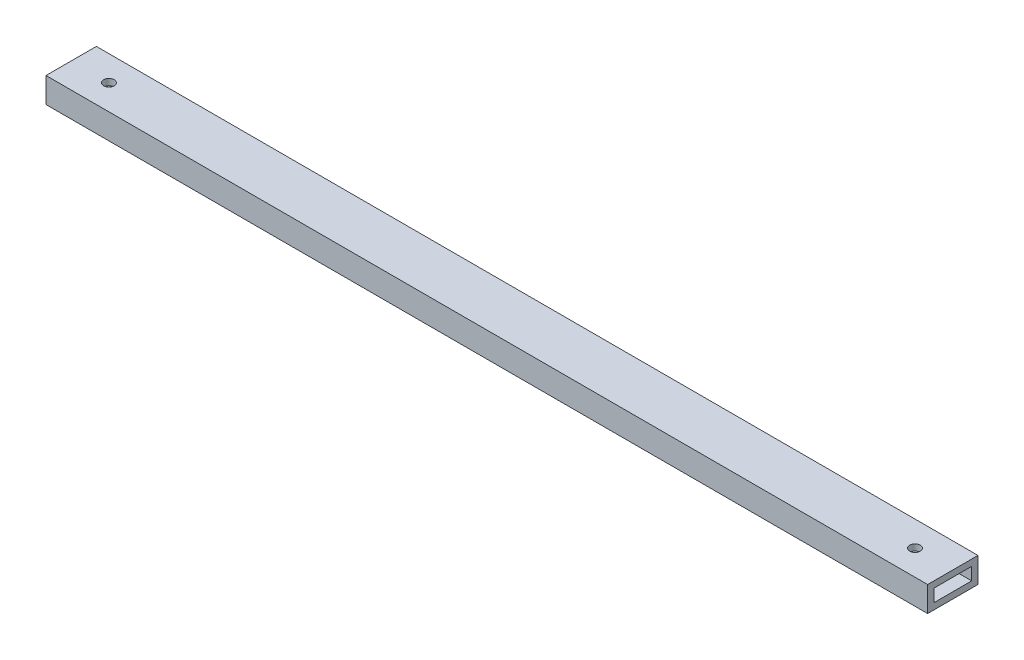
ISO-10303-21;
HEADER;
FILE_DESCRIPTION(('STEP AP214'),'2;1');
FILE_NAME('part.step','',(''),(''),'','','');
FILE_SCHEMA(('AUTOMOTIVE_DESIGN { 1 0 10303 214 1 1 1 1 }'));
ENDSEC;
DATA;
#1=APPLICATION_CONTEXT('core data for automotive mechanical design processes');
#2=APPLICATION_PROTOCOL_DEFINITION('international standard','automotive_design',2000,#1);
#3=PRODUCT_CONTEXT('',#1,'mechanical');
#4=PRODUCT('Part','Part','',(#3));
#5=PRODUCT_RELATED_PRODUCT_CATEGORY('part','',(#4));
#6=PRODUCT_DEFINITION_FORMATION('','',#4);
#7=PRODUCT_DEFINITION_CONTEXT('part definition',#1,'design');
#8=PRODUCT_DEFINITION('design','',#6,#7);
#9=PRODUCT_DEFINITION_SHAPE('','',#8);
#10=(LENGTH_UNIT() NAMED_UNIT(*) SI_UNIT(.MILLI.,.METRE.));
#11=(NAMED_UNIT(*) PLANE_ANGLE_UNIT() SI_UNIT($,.RADIAN.));
#12=(NAMED_UNIT(*) SI_UNIT($,.STERADIAN.) SOLID_ANGLE_UNIT());
#13=UNCERTAINTY_MEASURE_WITH_UNIT(LENGTH_MEASURE(1.E-05),#10,'distance_accuracy_value','');
#14=(GEOMETRIC_REPRESENTATION_CONTEXT(3) GLOBAL_UNCERTAINTY_ASSIGNED_CONTEXT((#13)) GLOBAL_UNIT_ASSIGNED_CONTEXT((#10,
#11,#12)) REPRESENTATION_CONTEXT('',''));
#15=CARTESIAN_POINT('',(0.,0.,0.));
#16=DIRECTION('',(0.,0.,1.));
#17=DIRECTION('',(1.,0.,0.));
#18=AXIS2_PLACEMENT_3D('',#15,#16,#17);
#19=CARTESIAN_POINT('',(444.5,0.,0.));
#20=DIRECTION('',(-1.,0.,0.));
#21=DIRECTION('',(0.,0.,1.));
#22=AXIS2_PLACEMENT_3D('',#19,#20,#21);
#23=PLANE('',#22);
#24=DIRECTION('',(0.,-1.,0.));
#25=VECTOR('',#24,1.);
#26=CARTESIAN_POINT('',(444.5,0.,0.));
#27=LINE('',#26,#25);
#28=CARTESIAN_POINT('',(444.5,12.7,0.));
#29=VERTEX_POINT('',#28);
#30=CARTESIAN_POINT('',(444.5,0.,0.));
#31=VERTEX_POINT('',#30);
#32=EDGE_CURVE('E162',#29,#31,#27,.T.);
#33=ORIENTED_EDGE('',*,*,#32,.T.);
#34=DIRECTION('',(0.,0.,-1.));
#35=VECTOR('',#34,1.);
#36=CARTESIAN_POINT('',(444.5,0.,0.));
#37=LINE('',#36,#35);
#38=CARTESIAN_POINT('',(444.5,0.,-25.4));
#39=VERTEX_POINT('',#38);
#40=EDGE_CURVE('E166',#31,#39,#37,.T.);
#41=ORIENTED_EDGE('',*,*,#40,.T.);
#42=DIRECTION('',(0.,1.,0.));
#43=VECTOR('',#42,1.);
#44=CARTESIAN_POINT('',(444.5,0.,-25.4));
#45=LINE('',#44,#43);
#46=CARTESIAN_POINT('',(444.5,12.7,-25.4));
#47=VERTEX_POINT('',#46);
#48=EDGE_CURVE('E170',#39,#47,#45,.T.);
#49=ORIENTED_EDGE('',*,*,#48,.T.);
#50=DIRECTION('',(0.,0.,1.));
#51=VECTOR('',#50,1.);
#52=CARTESIAN_POINT('',(444.5,12.7,0.));
#53=LINE('',#52,#51);
#54=EDGE_CURVE('E173',#47,#29,#53,.T.);
#55=ORIENTED_EDGE('',*,*,#54,.T.);
#56=EDGE_LOOP('',(#33,#41,#49,#55));
#57=FACE_BOUND('',#56,.T.);
#58=DIRECTION('',(0.,-1.,0.));
#59=VECTOR('',#58,1.);
#60=CARTESIAN_POINT('',(444.5,3.175,-3.175));
#61=LINE('',#60,#59);
#62=CARTESIAN_POINT('',(444.5,9.525,-3.175));
#63=VERTEX_POINT('',#62);
#64=CARTESIAN_POINT('',(444.5,3.175,-3.175));
#65=VERTEX_POINT('',#64);
#66=EDGE_CURVE('E115',#63,#65,#61,.T.);
#67=ORIENTED_EDGE('',*,*,#66,.F.);
#68=DIRECTION('',(0.,0.,1.));
#69=VECTOR('',#68,1.);
#70=CARTESIAN_POINT('',(444.5,9.525,-3.175));
#71=LINE('',#70,#69);
#72=CARTESIAN_POINT('',(444.5,9.525,-22.225));
#73=VERTEX_POINT('',#72);
#74=EDGE_CURVE('E143',#73,#63,#71,.T.);
#75=ORIENTED_EDGE('',*,*,#74,.F.);
#76=DIRECTION('',(0.,1.,0.));
#77=VECTOR('',#76,1.);
#78=CARTESIAN_POINT('',(444.5,3.175,-22.225));
#79=LINE('',#78,#77);
#80=CARTESIAN_POINT('',(444.5,3.175,-22.225));
#81=VERTEX_POINT('',#80);
#82=EDGE_CURVE('E137',#81,#73,#79,.T.);
#83=ORIENTED_EDGE('',*,*,#82,.F.);
#84=DIRECTION('',(0.,0.,-1.));
#85=VECTOR('',#84,1.);
#86=CARTESIAN_POINT('',(444.5,3.175,-3.175));
#87=LINE('',#86,#85);
#88=EDGE_CURVE('E124',#65,#81,#87,.T.);
#89=ORIENTED_EDGE('',*,*,#88,.F.);
#90=EDGE_LOOP('',(#67,#75,#83,#89));
#91=FACE_BOUND('',#90,.T.);
#92=ADVANCED_FACE('F38',(#57,#91),#23,.F.);
#93=CARTESIAN_POINT('',(0.,0.,0.));
#94=DIRECTION('',(-1.,0.,0.));
#95=DIRECTION('',(0.,0.,1.));
#96=AXIS2_PLACEMENT_3D('',#93,#94,#95);
#97=PLANE('',#96);
#98=DIRECTION('',(0.,-1.,0.));
#99=VECTOR('',#98,1.);
#100=CARTESIAN_POINT('',(0.,0.,0.));
#101=LINE('',#100,#99);
#102=CARTESIAN_POINT('',(0.,12.7,0.));
#103=VERTEX_POINT('',#102);
#104=CARTESIAN_POINT('',(0.,0.,0.));
#105=VERTEX_POINT('',#104);
#106=EDGE_CURVE('E133',#103,#105,#101,.T.);
#107=ORIENTED_EDGE('',*,*,#106,.F.);
#108=DIRECTION('',(0.,0.,1.));
#109=VECTOR('',#108,1.);
#110=CARTESIAN_POINT('',(0.,12.7,0.));
#111=LINE('',#110,#109);
#112=CARTESIAN_POINT('',(0.,12.7,-25.4));
#113=VERTEX_POINT('',#112);
#114=EDGE_CURVE('E167',#113,#103,#111,.T.);
#115=ORIENTED_EDGE('',*,*,#114,.F.);
#116=DIRECTION('',(0.,1.,0.));
#117=VECTOR('',#116,1.);
#118=CARTESIAN_POINT('',(0.,0.,-25.4));
#119=LINE('',#118,#117);
#120=CARTESIAN_POINT('',(0.,0.,-25.4));
#121=VERTEX_POINT('',#120);
#122=EDGE_CURVE('E183',#121,#113,#119,.T.);
#123=ORIENTED_EDGE('',*,*,#122,.F.);
#124=DIRECTION('',(0.,0.,-1.));
#125=VECTOR('',#124,1.);
#126=CARTESIAN_POINT('',(0.,0.,0.));
#127=LINE('',#126,#125);
#128=EDGE_CURVE('E180',#105,#121,#127,.T.);
#129=ORIENTED_EDGE('',*,*,#128,.F.);
#130=EDGE_LOOP('',(#107,#115,#123,#129));
#131=FACE_BOUND('',#130,.T.);
#132=DIRECTION('',(0.,0.,1.));
#133=VECTOR('',#132,1.);
#134=CARTESIAN_POINT('',(0.,9.525,-3.175));
#135=LINE('',#134,#133);
#136=CARTESIAN_POINT('',(0.,9.525,-22.225));
#137=VERTEX_POINT('',#136);
#138=CARTESIAN_POINT('',(0.,9.525,-3.175));
#139=VERTEX_POINT('',#138);
#140=EDGE_CURVE('E125',#137,#139,#135,.T.);
#141=ORIENTED_EDGE('',*,*,#140,.T.);
#142=DIRECTION('',(0.,-1.,0.));
#143=VECTOR('',#142,1.);
#144=CARTESIAN_POINT('',(0.,3.175,-3.175));
#145=LINE('',#144,#143);
#146=CARTESIAN_POINT('',(0.,3.175,-3.175));
#147=VERTEX_POINT('',#146);
#148=EDGE_CURVE('E67',#139,#147,#145,.T.);
#149=ORIENTED_EDGE('',*,*,#148,.T.);
#150=DIRECTION('',(0.,0.,-1.));
#151=VECTOR('',#150,1.);
#152=CARTESIAN_POINT('',(0.,3.175,-3.175));
#153=LINE('',#152,#151);
#154=CARTESIAN_POINT('',(0.,3.175,-22.225));
#155=VERTEX_POINT('',#154);
#156=EDGE_CURVE('E131',#147,#155,#153,.T.);
#157=ORIENTED_EDGE('',*,*,#156,.T.);
#158=DIRECTION('',(0.,1.,0.));
#159=VECTOR('',#158,1.);
#160=CARTESIAN_POINT('',(0.,3.175,-22.225));
#161=LINE('',#160,#159);
#162=EDGE_CURVE('E151',#155,#137,#161,.T.);
#163=ORIENTED_EDGE('',*,*,#162,.T.);
#164=EDGE_LOOP('',(#141,#149,#157,#163));
#165=FACE_BOUND('',#164,.T.);
#166=ADVANCED_FACE('F236',(#131,#165),#97,.T.);
#167=CARTESIAN_POINT('',(444.5,0.,0.));
#168=DIRECTION('',(0.,0.,-1.));
#169=DIRECTION('',(-1.,0.,0.));
#170=AXIS2_PLACEMENT_3D('',#167,#168,#169);
#171=PLANE('',#170);
#172=ORIENTED_EDGE('',*,*,#106,.T.);
#173=DIRECTION('',(-1.,0.,0.));
#174=VECTOR('',#173,1.);
#175=CARTESIAN_POINT('',(444.5,0.,0.));
#176=LINE('',#175,#174);
#177=EDGE_CURVE('E11',#31,#105,#176,.T.);
#178=ORIENTED_EDGE('',*,*,#177,.F.);
#179=ORIENTED_EDGE('',*,*,#32,.F.);
#180=DIRECTION('',(-1.,0.,0.));
#181=VECTOR('',#180,1.);
#182=CARTESIAN_POINT('',(444.5,12.7,0.));
#183=LINE('',#182,#181);
#184=EDGE_CURVE('E176',#29,#103,#183,.T.);
#185=ORIENTED_EDGE('',*,*,#184,.T.);
#186=EDGE_LOOP('',(#172,#178,#179,#185));
#187=FACE_BOUND('',#186,.T.);
#188=ADVANCED_FACE('F40',(#187),#171,.F.);
#189=CARTESIAN_POINT('',(444.5,0.,0.));
#190=DIRECTION('',(0.,1.,0.));
#191=DIRECTION('',(0.,0.,1.));
#192=AXIS2_PLACEMENT_3D('',#189,#190,#191);
#193=PLANE('',#192);
#194=CARTESIAN_POINT('',(19.05,0.,-12.7));
#195=DIRECTION('',(0.,1.,0.));
#196=DIRECTION('',(0.,0.,1.));
#197=AXIS2_PLACEMENT_3D('',#194,#195,#196);
#198=CIRCLE('',#197,2.667);
#199=CARTESIAN_POINT('',(19.05,0.,-10.033));
#200=VERTEX_POINT('',#199);
#201=EDGE_CURVE('E199',#200,#200,#198,.T.);
#202=ORIENTED_EDGE('',*,*,#201,.T.);
#203=EDGE_LOOP('',(#202));
#204=FACE_BOUND('',#203,.T.);
#205=CARTESIAN_POINT('',(425.45,0.,-12.7));
#206=DIRECTION('',(0.,1.,0.));
#207=DIRECTION('',(0.,0.,-1.));
#208=AXIS2_PLACEMENT_3D('',#205,#206,#207);
#209=CIRCLE('',#208,2.66700000000002);
#210=CARTESIAN_POINT('',(425.45,0.,-15.367));
#211=VERTEX_POINT('',#210);
#212=EDGE_CURVE('E212',#211,#211,#209,.T.);
#213=ORIENTED_EDGE('',*,*,#212,.T.);
#214=EDGE_LOOP('',(#213));
#215=FACE_BOUND('',#214,.T.);
#216=ORIENTED_EDGE('',*,*,#128,.T.);
#217=DIRECTION('',(-1.,0.,0.));
#218=VECTOR('',#217,1.);
#219=CARTESIAN_POINT('',(444.5,0.,-25.4));
#220=LINE('',#219,#218);
#221=EDGE_CURVE('E48',#39,#121,#220,.T.);
#222=ORIENTED_EDGE('',*,*,#221,.F.);
#223=ORIENTED_EDGE('',*,*,#40,.F.);
#224=ORIENTED_EDGE('',*,*,#177,.T.);
#225=EDGE_LOOP('',(#216,#222,#223,#224));
#226=FACE_BOUND('',#225,.T.);
#227=ADVANCED_FACE('F261',(#204,#215,#226),#193,.F.);
#228=CARTESIAN_POINT('',(444.5,0.,-25.4));
#229=DIRECTION('',(0.,0.,1.));
#230=DIRECTION('',(1.,0.,0.));
#231=AXIS2_PLACEMENT_3D('',#228,#229,#230);
#232=PLANE('',#231);
#233=ORIENTED_EDGE('',*,*,#122,.T.);
#234=DIRECTION('',(-1.,0.,0.));
#235=VECTOR('',#234,1.);
#236=CARTESIAN_POINT('',(444.5,12.7,-25.4));
#237=LINE('',#236,#235);
#238=EDGE_CURVE('E189',#47,#113,#237,.T.);
#239=ORIENTED_EDGE('',*,*,#238,.F.);
#240=ORIENTED_EDGE('',*,*,#48,.F.);
#241=ORIENTED_EDGE('',*,*,#221,.T.);
#242=EDGE_LOOP('',(#233,#239,#240,#241));
#243=FACE_BOUND('',#242,.T.);
#244=ADVANCED_FACE('F258',(#243),#232,.F.);
#245=CARTESIAN_POINT('',(444.5,12.7,0.));
#246=DIRECTION('',(0.,-1.,0.));
#247=DIRECTION('',(0.,0.,-1.));
#248=AXIS2_PLACEMENT_3D('',#245,#246,#247);
#249=PLANE('',#248);
#250=CARTESIAN_POINT('',(19.05,12.7,-12.7));
#251=DIRECTION('',(0.,1.,0.));
#252=DIRECTION('',(0.,0.,1.));
#253=AXIS2_PLACEMENT_3D('',#250,#251,#252);
#254=CIRCLE('',#253,2.667);
#255=CARTESIAN_POINT('',(19.05,12.7,-10.033));
#256=VERTEX_POINT('',#255);
#257=EDGE_CURVE('E207',#256,#256,#254,.T.);
#258=ORIENTED_EDGE('',*,*,#257,.F.);
#259=EDGE_LOOP('',(#258));
#260=FACE_BOUND('',#259,.T.);
#261=CARTESIAN_POINT('',(425.45,12.7,-12.7));
#262=DIRECTION('',(0.,1.,0.));
#263=DIRECTION('',(0.,0.,-1.));
#264=AXIS2_PLACEMENT_3D('',#261,#262,#263);
#265=CIRCLE('',#264,2.66700000000002);
#266=CARTESIAN_POINT('',(425.45,12.7,-15.367));
#267=VERTEX_POINT('',#266);
#268=EDGE_CURVE('E217',#267,#267,#265,.T.);
#269=ORIENTED_EDGE('',*,*,#268,.F.);
#270=EDGE_LOOP('',(#269));
#271=FACE_BOUND('',#270,.T.);
#272=ORIENTED_EDGE('',*,*,#114,.T.);
#273=ORIENTED_EDGE('',*,*,#184,.F.);
#274=ORIENTED_EDGE('',*,*,#54,.F.);
#275=ORIENTED_EDGE('',*,*,#238,.T.);
#276=EDGE_LOOP('',(#272,#273,#274,#275));
#277=FACE_BOUND('',#276,.T.);
#278=ADVANCED_FACE('F255',(#260,#271,#277),#249,.F.);
#279=CARTESIAN_POINT('',(444.5,3.175,-3.175));
#280=DIRECTION('',(0.,0.,-1.));
#281=DIRECTION('',(-1.,0.,0.));
#282=AXIS2_PLACEMENT_3D('',#279,#280,#281);
#283=PLANE('',#282);
#284=ORIENTED_EDGE('',*,*,#148,.F.);
#285=DIRECTION('',(-1.,0.,0.));
#286=VECTOR('',#285,1.);
#287=CARTESIAN_POINT('',(444.5,9.525,-3.175));
#288=LINE('',#287,#286);
#289=EDGE_CURVE('E119',#63,#139,#288,.T.);
#290=ORIENTED_EDGE('',*,*,#289,.F.);
#291=ORIENTED_EDGE('',*,*,#66,.T.);
#292=DIRECTION('',(-1.,0.,0.));
#293=VECTOR('',#292,1.);
#294=CARTESIAN_POINT('',(444.5,3.175,-3.175));
#295=LINE('',#294,#293);
#296=EDGE_CURVE('E118',#65,#147,#295,.T.);
#297=ORIENTED_EDGE('',*,*,#296,.T.);
#298=EDGE_LOOP('',(#284,#290,#291,#297));
#299=FACE_BOUND('',#298,.T.);
#300=ADVANCED_FACE('F117',(#299),#283,.T.);
#301=CARTESIAN_POINT('',(444.5,3.175,-3.175));
#302=DIRECTION('',(0.,1.,0.));
#303=DIRECTION('',(0.,0.,1.));
#304=AXIS2_PLACEMENT_3D('',#301,#302,#303);
#305=PLANE('',#304);
#306=CARTESIAN_POINT('',(19.05,3.175,-12.7));
#307=DIRECTION('',(0.,1.,0.));
#308=DIRECTION('',(0.,0.,1.));
#309=AXIS2_PLACEMENT_3D('',#306,#307,#308);
#310=CIRCLE('',#309,2.667);
#311=CARTESIAN_POINT('',(19.05,3.175,-10.033));
#312=VERTEX_POINT('',#311);
#313=EDGE_CURVE('E149',#312,#312,#310,.T.);
#314=ORIENTED_EDGE('',*,*,#313,.F.);
#315=EDGE_LOOP('',(#314));
#316=FACE_BOUND('',#315,.T.);
#317=CARTESIAN_POINT('',(425.45,3.175,-12.7));
#318=DIRECTION('',(0.,1.,0.));
#319=DIRECTION('',(0.,0.,1.));
#320=AXIS2_PLACEMENT_3D('',#317,#318,#319);
#321=CIRCLE('',#320,2.66700000000002);
#322=CARTESIAN_POINT('',(425.45,3.175,-10.033));
#323=VERTEX_POINT('',#322);
#324=EDGE_CURVE('E198',#323,#323,#321,.T.);
#325=ORIENTED_EDGE('',*,*,#324,.F.);
#326=EDGE_LOOP('',(#325));
#327=FACE_BOUND('',#326,.T.);
#328=ORIENTED_EDGE('',*,*,#156,.F.);
#329=ORIENTED_EDGE('',*,*,#296,.F.);
#330=ORIENTED_EDGE('',*,*,#88,.T.);
#331=DIRECTION('',(-1.,0.,0.));
#332=VECTOR('',#331,1.);
#333=CARTESIAN_POINT('',(444.5,3.175,-22.225));
#334=LINE('',#333,#332);
#335=EDGE_CURVE('E134',#81,#155,#334,.T.);
#336=ORIENTED_EDGE('',*,*,#335,.T.);
#337=EDGE_LOOP('',(#328,#329,#330,#336));
#338=FACE_BOUND('',#337,.T.);
#339=ADVANCED_FACE('F128',(#316,#327,#338),#305,.T.);
#340=CARTESIAN_POINT('',(444.5,3.175,-22.225));
#341=DIRECTION('',(0.,0.,1.));
#342=DIRECTION('',(1.,0.,0.));
#343=AXIS2_PLACEMENT_3D('',#340,#341,#342);
#344=PLANE('',#343);
#345=ORIENTED_EDGE('',*,*,#162,.F.);
#346=ORIENTED_EDGE('',*,*,#335,.F.);
#347=ORIENTED_EDGE('',*,*,#82,.T.);
#348=DIRECTION('',(-1.,0.,0.));
#349=VECTOR('',#348,1.);
#350=CARTESIAN_POINT('',(444.5,9.525,-22.225));
#351=LINE('',#350,#349);
#352=EDGE_CURVE('E59',#73,#137,#351,.T.);
#353=ORIENTED_EDGE('',*,*,#352,.T.);
#354=EDGE_LOOP('',(#345,#346,#347,#353));
#355=FACE_BOUND('',#354,.T.);
#356=ADVANCED_FACE('F232',(#355),#344,.T.);
#357=CARTESIAN_POINT('',(444.5,9.525,-3.175));
#358=DIRECTION('',(0.,-1.,0.));
#359=DIRECTION('',(0.,0.,-1.));
#360=AXIS2_PLACEMENT_3D('',#357,#358,#359);
#361=PLANE('',#360);
#362=CARTESIAN_POINT('',(19.05,9.525,-12.7));
#363=DIRECTION('',(0.,-1.,0.));
#364=DIRECTION('',(0.,0.,-1.));
#365=AXIS2_PLACEMENT_3D('',#362,#363,#364);
#366=CIRCLE('',#365,2.667);
#367=CARTESIAN_POINT('',(19.05,9.525,-15.367));
#368=VERTEX_POINT('',#367);
#369=EDGE_CURVE('E42',#368,#368,#366,.T.);
#370=ORIENTED_EDGE('',*,*,#369,.F.);
#371=EDGE_LOOP('',(#370));
#372=FACE_BOUND('',#371,.T.);
#373=CARTESIAN_POINT('',(425.45,9.525,-12.7));
#374=DIRECTION('',(0.,-1.,0.));
#375=DIRECTION('',(0.,0.,-1.));
#376=AXIS2_PLACEMENT_3D('',#373,#374,#375);
#377=CIRCLE('',#376,2.66700000000002);
#378=CARTESIAN_POINT('',(425.45,9.525,-15.367));
#379=VERTEX_POINT('',#378);
#380=EDGE_CURVE('E195',#379,#379,#377,.T.);
#381=ORIENTED_EDGE('',*,*,#380,.F.);
#382=EDGE_LOOP('',(#381));
#383=FACE_BOUND('',#382,.T.);
#384=ORIENTED_EDGE('',*,*,#140,.F.);
#385=ORIENTED_EDGE('',*,*,#352,.F.);
#386=ORIENTED_EDGE('',*,*,#74,.T.);
#387=ORIENTED_EDGE('',*,*,#289,.T.);
#388=EDGE_LOOP('',(#384,#385,#386,#387));
#389=FACE_BOUND('',#388,.T.);
#390=ADVANCED_FACE('F228',(#372,#383,#389),#361,.T.);
#391=CARTESIAN_POINT('',(425.45,0.,-12.7));
#392=DIRECTION('',(0.,1.,0.));
#393=DIRECTION('',(0.,0.,1.));
#394=AXIS2_PLACEMENT_3D('',#391,#392,#393);
#395=CYLINDRICAL_SURFACE('',#394,2.66700000000002);
#396=ORIENTED_EDGE('',*,*,#380,.T.);
#397=EDGE_LOOP('',(#396));
#398=FACE_BOUND('',#397,.T.);
#399=ORIENTED_EDGE('',*,*,#268,.T.);
#400=EDGE_LOOP('',(#399));
#401=FACE_BOUND('',#400,.T.);
#402=ADVANCED_FACE('F231',(#398,#401),#395,.F.);
#403=CARTESIAN_POINT('',(19.05,0.,-12.7));
#404=DIRECTION('',(0.,1.,0.));
#405=DIRECTION('',(0.,0.,1.));
#406=AXIS2_PLACEMENT_3D('',#403,#404,#405);
#407=CYLINDRICAL_SURFACE('',#406,2.667);
#408=ORIENTED_EDGE('',*,*,#369,.T.);
#409=EDGE_LOOP('',(#408));
#410=FACE_BOUND('',#409,.T.);
#411=ORIENTED_EDGE('',*,*,#257,.T.);
#412=EDGE_LOOP('',(#411));
#413=FACE_BOUND('',#412,.T.);
#414=ADVANCED_FACE('F225',(#410,#413),#407,.F.);
#415=ORIENTED_EDGE('',*,*,#324,.T.);
#416=EDGE_LOOP('',(#415));
#417=FACE_BOUND('',#416,.T.);
#418=ORIENTED_EDGE('',*,*,#212,.F.);
#419=EDGE_LOOP('',(#418));
#420=FACE_BOUND('',#419,.T.);
#421=ADVANCED_FACE('F283',(#417,#420),#395,.F.);
#422=ORIENTED_EDGE('',*,*,#313,.T.);
#423=EDGE_LOOP('',(#422));
#424=FACE_BOUND('',#423,.T.);
#425=ORIENTED_EDGE('',*,*,#201,.F.);
#426=EDGE_LOOP('',(#425));
#427=FACE_BOUND('',#426,.T.);
#428=ADVANCED_FACE('F285',(#424,#427),#407,.F.);
#429=CLOSED_SHELL('',(#92,#166,#188,#227,#244,#278,#300,#339,#356,#390,#402,#414,#421,#428));
#430=MANIFOLD_SOLID_BREP('B2',#429);
#431=ADVANCED_BREP_SHAPE_REPRESENTATION('',(#18,#430),#14);
#432=SHAPE_DEFINITION_REPRESENTATION(#9,#431);
ENDSEC;
END-ISO-10303-21;
